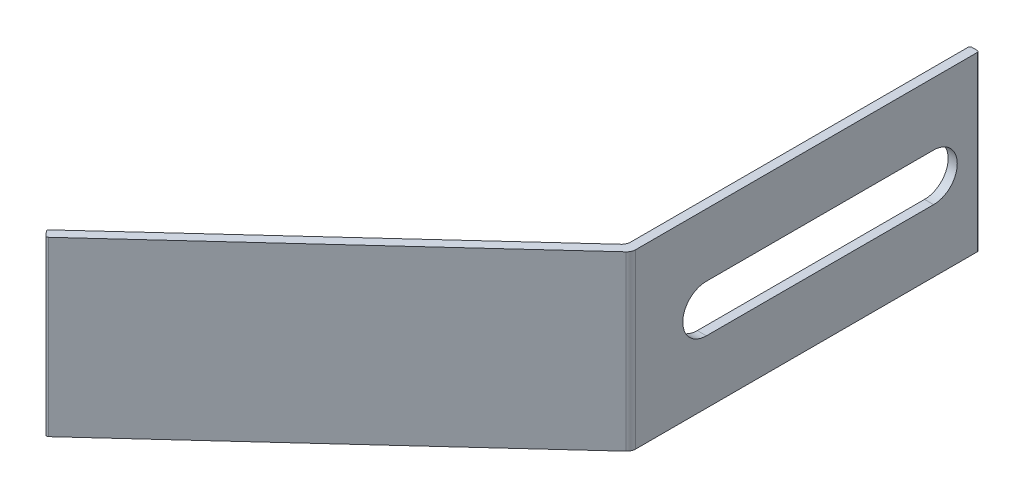
ISO-10303-21;
HEADER;
FILE_DESCRIPTION(('STEP AP214'),'2;1');
FILE_NAME('part.step','',(''),(''),'','','');
FILE_SCHEMA(('AUTOMOTIVE_DESIGN { 1 0 10303 214 1 1 1 1 }'));
ENDSEC;
DATA;
#1=APPLICATION_CONTEXT('core data for automotive mechanical design processes');
#2=APPLICATION_PROTOCOL_DEFINITION('international standard','automotive_design',2000,#1);
#3=PRODUCT_CONTEXT('',#1,'mechanical');
#4=PRODUCT('Part','Part','',(#3));
#5=PRODUCT_RELATED_PRODUCT_CATEGORY('part','',(#4));
#6=PRODUCT_DEFINITION_FORMATION('','',#4);
#7=PRODUCT_DEFINITION_CONTEXT('part definition',#1,'design');
#8=PRODUCT_DEFINITION('design','',#6,#7);
#9=PRODUCT_DEFINITION_SHAPE('','',#8);
#10=(LENGTH_UNIT() NAMED_UNIT(*) SI_UNIT(.MILLI.,.METRE.));
#11=(NAMED_UNIT(*) PLANE_ANGLE_UNIT() SI_UNIT($,.RADIAN.));
#12=(NAMED_UNIT(*) SI_UNIT($,.STERADIAN.) SOLID_ANGLE_UNIT());
#13=UNCERTAINTY_MEASURE_WITH_UNIT(LENGTH_MEASURE(1.E-05),#10,'distance_accuracy_value','');
#14=(GEOMETRIC_REPRESENTATION_CONTEXT(3) GLOBAL_UNCERTAINTY_ASSIGNED_CONTEXT((#13)) GLOBAL_UNIT_ASSIGNED_CONTEXT((#10,
#11,#12)) REPRESENTATION_CONTEXT('',''));
#15=CARTESIAN_POINT('',(0.,0.,0.));
#16=DIRECTION('',(0.,0.,1.));
#17=DIRECTION('',(1.,0.,0.));
#18=AXIS2_PLACEMENT_3D('',#15,#16,#17);
#19=CARTESIAN_POINT('',(-0.337795103807825,9.5,37.6313613315949));
#20=DIRECTION('',(0.675590207615659,0.,0.737277336810125));
#21=DIRECTION('',(0.737277336810125,0.,-0.675590207615659));
#22=AXIS2_PLACEMENT_3D('',#19,#20,#21);
#23=PLANE('',#22);
#24=DIRECTION('',(-0.737277336810125,0.,0.675590207615659));
#25=VECTOR('',#24,1.);
#26=CARTESIAN_POINT('',(-0.337795103807825,-9.5,37.6313613315949));
#27=LINE('',#26,#25);
#28=CARTESIAN_POINT('',(-0.824409792384336,-9.5,38.0772615404724));
#29=VERTEX_POINT('',#28);
#30=CARTESIAN_POINT('',(-33.6627307276255,-9.5,68.1680387158227));
#31=VERTEX_POINT('',#30);
#32=EDGE_CURVE('E200',#29,#31,#27,.T.);
#33=ORIENTED_EDGE('',*,*,#32,.T.);
#34=DIRECTION('',(0.,-1.,0.));
#35=VECTOR('',#34,1.);
#36=CARTESIAN_POINT('',(-33.6627307276255,9.5,68.1680387158227));
#37=LINE('',#36,#35);
#38=CARTESIAN_POINT('',(-33.6627307276255,9.5,68.1680387158227));
#39=VERTEX_POINT('',#38);
#40=EDGE_CURVE('E313',#31,#39,#37,.F.);
#41=ORIENTED_EDGE('',*,*,#40,.T.);
#42=DIRECTION('',(-0.737277336810125,0.,0.675590207615659));
#43=VECTOR('',#42,1.);
#44=CARTESIAN_POINT('',(-0.337795103807825,9.5,37.6313613315949));
#45=LINE('',#44,#43);
#46=CARTESIAN_POINT('',(-0.824409792384336,9.5,38.0772615404724));
#47=VERTEX_POINT('',#46);
#48=EDGE_CURVE('E206',#47,#39,#45,.T.);
#49=ORIENTED_EDGE('',*,*,#48,.F.);
#50=DIRECTION('',(0.,-1.,0.));
#51=VECTOR('',#50,1.);
#52=CARTESIAN_POINT('',(-0.824409792384336,-9.5,38.0772615404724));
#53=LINE('',#52,#51);
#54=EDGE_CURVE('E229',#47,#29,#53,.T.);
#55=ORIENTED_EDGE('',*,*,#54,.T.);
#56=EDGE_LOOP('',(#33,#41,#49,#55));
#57=FACE_BOUND('',#56,.T.);
#58=ADVANCED_FACE('F43',(#57),#23,.F.);
#59=CARTESIAN_POINT('',(-33.1345959873718,9.5,69.040434094156));
#60=DIRECTION('',(-0.737277336810122,0.,0.675590207615663));
#61=DIRECTION('',(0.675590207615663,0.,0.737277336810122));
#62=AXIS2_PLACEMENT_3D('',#59,#60,#61);
#63=PLANE('',#62);
#64=DIRECTION('',(-0.675590207615663,0.,-0.737277336810122));
#65=VECTOR('',#64,1.);
#66=CARTESIAN_POINT('',(-33.1345959873718,-9.5,69.040434094156));
#67=LINE('',#66,#65);
#68=CARTESIAN_POINT('',(-33.269714028895,-9.5,68.892978626794));
#69=VERTEX_POINT('',#68);
#70=CARTESIAN_POINT('',(-33.6750681534644,-9.5,68.4506122247079));
#71=VERTEX_POINT('',#70);
#72=EDGE_CURVE('E233',#69,#71,#67,.T.);
#73=ORIENTED_EDGE('',*,*,#72,.F.);
#74=DIRECTION('',(0.,-1.,0.));
#75=VECTOR('',#74,1.);
#76=CARTESIAN_POINT('',(-33.269714028895,9.5,68.892978626794));
#77=LINE('',#76,#75);
#78=CARTESIAN_POINT('',(-33.269714028895,9.5,68.892978626794));
#79=VERTEX_POINT('',#78);
#80=EDGE_CURVE('E298',#69,#79,#77,.F.);
#81=ORIENTED_EDGE('',*,*,#80,.T.);
#82=DIRECTION('',(-0.675590207615663,0.,-0.737277336810122));
#83=VECTOR('',#82,1.);
#84=CARTESIAN_POINT('',(-33.1345959873718,9.5,69.040434094156));
#85=LINE('',#84,#83);
#86=CARTESIAN_POINT('',(-33.6750681534644,9.5,68.4506122247079));
#87=VERTEX_POINT('',#86);
#88=EDGE_CURVE('E210',#79,#87,#85,.T.);
#89=ORIENTED_EDGE('',*,*,#88,.T.);
#90=DIRECTION('',(0.,-1.,0.));
#91=VECTOR('',#90,1.);
#92=CARTESIAN_POINT('',(-33.6750681534644,-9.5,68.4506122247079));
#93=LINE('',#92,#91);
#94=EDGE_CURVE('E294',#87,#71,#93,.T.);
#95=ORIENTED_EDGE('',*,*,#94,.T.);
#96=EDGE_LOOP('',(#73,#81,#89,#95));
#97=FACE_BOUND('',#96,.T.);
#98=ADVANCED_FACE('F366',(#97),#63,.T.);
#99=CARTESIAN_POINT('',(0.337795103807834,9.5,38.3686386684051));
#100=DIRECTION('',(0.675590207615659,0.,0.737277336810125));
#101=DIRECTION('',(0.737277336810125,0.,-0.675590207615659));
#102=AXIS2_PLACEMENT_3D('',#99,#100,#101);
#103=PLANE('',#102);
#104=DIRECTION('',(-0.737277336810125,0.,0.675590207615659));
#105=VECTOR('',#104,1.);
#106=CARTESIAN_POINT('',(0.337795103807834,9.5,38.3686386684051));
#107=LINE('',#106,#105);
#108=CARTESIAN_POINT('',(0.175590207615663,9.5,38.5172720713642));
#109=VERTEX_POINT('',#108);
#110=CARTESIAN_POINT('',(-32.9871405200098,9.5,68.9053160526328));
#111=VERTEX_POINT('',#110);
#112=EDGE_CURVE('E215',#109,#111,#107,.T.);
#113=ORIENTED_EDGE('',*,*,#112,.T.);
#114=DIRECTION('',(0.,-1.,0.));
#115=VECTOR('',#114,1.);
#116=CARTESIAN_POINT('',(-32.9871405200098,9.5,68.9053160526328));
#117=LINE('',#116,#115);
#118=CARTESIAN_POINT('',(-32.9871405200098,-9.5,68.9053160526328));
#119=VERTEX_POINT('',#118);
#120=EDGE_CURVE('E278',#111,#119,#117,.T.);
#121=ORIENTED_EDGE('',*,*,#120,.T.);
#122=DIRECTION('',(-0.737277336810125,0.,0.675590207615659));
#123=VECTOR('',#122,1.);
#124=CARTESIAN_POINT('',(0.337795103807834,-9.5,38.3686386684051));
#125=LINE('',#124,#123);
#126=CARTESIAN_POINT('',(0.175590207615663,-9.5,38.5172720713642));
#127=VERTEX_POINT('',#126);
#128=EDGE_CURVE('E237',#127,#119,#125,.T.);
#129=ORIENTED_EDGE('',*,*,#128,.F.);
#130=DIRECTION('',(0.,-1.,0.));
#131=VECTOR('',#130,1.);
#132=CARTESIAN_POINT('',(0.175590207615663,9.5,38.5172720713642));
#133=LINE('',#132,#131);
#134=EDGE_CURVE('E264',#127,#109,#133,.F.);
#135=ORIENTED_EDGE('',*,*,#134,.T.);
#136=EDGE_LOOP('',(#113,#121,#129,#135));
#137=FACE_BOUND('',#136,.T.);
#138=ADVANCED_FACE('F372',(#137),#103,.T.);
#139=CARTESIAN_POINT('',(0.5,9.5,0.));
#140=DIRECTION('',(1.,0.,0.));
#141=DIRECTION('',(0.,0.,-1.));
#142=AXIS2_PLACEMENT_3D('',#139,#140,#141);
#143=PLANE('',#142);
#144=CARTESIAN_POINT('',(0.500000000000005,0.,5.));
#145=DIRECTION('',(-1.,0.,0.));
#146=DIRECTION('',(0.,0.,-1.));
#147=AXIS2_PLACEMENT_3D('',#144,#145,#146);
#148=CIRCLE('',#147,2.6);
#149=CARTESIAN_POINT('',(0.500000000000005,2.6,5.));
#150=VERTEX_POINT('',#149);
#151=CARTESIAN_POINT('',(0.500000000000005,-2.6,5.));
#152=VERTEX_POINT('',#151);
#153=EDGE_CURVE('E159',#150,#152,#148,.T.);
#154=ORIENTED_EDGE('',*,*,#153,.T.);
#155=DIRECTION('',(0.,0.,1.));
#156=VECTOR('',#155,1.);
#157=CARTESIAN_POINT('',(0.500000000000008,-2.6,30.));
#158=LINE('',#157,#156);
#159=CARTESIAN_POINT('',(0.500000000000004,-2.6,30.));
#160=VERTEX_POINT('',#159);
#161=EDGE_CURVE('E169',#152,#160,#158,.T.);
#162=ORIENTED_EDGE('',*,*,#161,.T.);
#163=CARTESIAN_POINT('',(0.500000000000008,0.,30.));
#164=DIRECTION('',(-1.,0.,0.));
#165=DIRECTION('',(0.,0.,-1.));
#166=AXIS2_PLACEMENT_3D('',#163,#164,#165);
#167=CIRCLE('',#166,2.6);
#168=CARTESIAN_POINT('',(0.500000000000008,2.6,30.));
#169=VERTEX_POINT('',#168);
#170=EDGE_CURVE('E59',#160,#169,#167,.T.);
#171=ORIENTED_EDGE('',*,*,#170,.T.);
#172=DIRECTION('',(0.,0.,-1.));
#173=VECTOR('',#172,1.);
#174=CARTESIAN_POINT('',(0.500000000000005,2.6,5.));
#175=LINE('',#174,#173);
#176=EDGE_CURVE('E166',#169,#150,#175,.T.);
#177=ORIENTED_EDGE('',*,*,#176,.T.);
#178=EDGE_LOOP('',(#154,#162,#171,#177));
#179=FACE_BOUND('',#178,.T.);
#180=DIRECTION('',(0.,0.,1.));
#181=VECTOR('',#180,1.);
#182=CARTESIAN_POINT('',(0.5,-9.5,0.));
#183=LINE('',#182,#181);
#184=CARTESIAN_POINT('',(0.5,-9.5,0.2));
#185=VERTEX_POINT('',#184);
#186=CARTESIAN_POINT('',(0.500000000000005,-9.5,37.7799947345541));
#187=VERTEX_POINT('',#186);
#188=EDGE_CURVE('E241',#185,#187,#183,.T.);
#189=ORIENTED_EDGE('',*,*,#188,.F.);
#190=DIRECTION('',(0.,-1.,0.));
#191=VECTOR('',#190,1.);
#192=CARTESIAN_POINT('',(0.5,9.5,0.2));
#193=LINE('',#192,#191);
#194=CARTESIAN_POINT('',(0.5,9.5,0.2));
#195=VERTEX_POINT('',#194);
#196=EDGE_CURVE('E52',#185,#195,#193,.F.);
#197=ORIENTED_EDGE('',*,*,#196,.T.);
#198=DIRECTION('',(0.,0.,1.));
#199=VECTOR('',#198,1.);
#200=CARTESIAN_POINT('',(0.5,9.5,0.));
#201=LINE('',#200,#199);
#202=CARTESIAN_POINT('',(0.500000000000005,9.5,37.7799947345541));
#203=VERTEX_POINT('',#202);
#204=EDGE_CURVE('E219',#195,#203,#201,.T.);
#205=ORIENTED_EDGE('',*,*,#204,.T.);
#206=DIRECTION('',(0.,-1.,0.));
#207=VECTOR('',#206,1.);
#208=CARTESIAN_POINT('',(0.500000000000005,9.5,37.7799947345541));
#209=LINE('',#208,#207);
#210=EDGE_CURVE('E257',#203,#187,#209,.T.);
#211=ORIENTED_EDGE('',*,*,#210,.T.);
#212=EDGE_LOOP('',(#189,#197,#205,#211));
#213=FACE_BOUND('',#212,.T.);
#214=ADVANCED_FACE('F174',(#179,#213),#143,.T.);
#215=CARTESIAN_POINT('',(-0.5,9.5,0.));
#216=DIRECTION('',(0.,0.,-1.));
#217=DIRECTION('',(-1.,0.,0.));
#218=AXIS2_PLACEMENT_3D('',#215,#216,#217);
#219=PLANE('',#218);
#220=DIRECTION('',(1.,0.,0.));
#221=VECTOR('',#220,1.);
#222=CARTESIAN_POINT('',(-0.5,9.5,0.));
#223=LINE('',#222,#221);
#224=CARTESIAN_POINT('',(-0.3,9.5,0.));
#225=VERTEX_POINT('',#224);
#226=CARTESIAN_POINT('',(0.3,9.5,0.));
#227=VERTEX_POINT('',#226);
#228=EDGE_CURVE('E222',#225,#227,#223,.T.);
#229=ORIENTED_EDGE('',*,*,#228,.T.);
#230=DIRECTION('',(0.,-1.,0.));
#231=VECTOR('',#230,1.);
#232=CARTESIAN_POINT('',(0.3,9.5,0.));
#233=LINE('',#232,#231);
#234=CARTESIAN_POINT('',(0.3,-9.5,0.));
#235=VERTEX_POINT('',#234);
#236=EDGE_CURVE('E319',#227,#235,#233,.T.);
#237=ORIENTED_EDGE('',*,*,#236,.T.);
#238=DIRECTION('',(1.,0.,0.));
#239=VECTOR('',#238,1.);
#240=CARTESIAN_POINT('',(-0.5,-9.5,0.));
#241=LINE('',#240,#239);
#242=CARTESIAN_POINT('',(-0.3,-9.5,0.));
#243=VERTEX_POINT('',#242);
#244=EDGE_CURVE('E244',#243,#235,#241,.T.);
#245=ORIENTED_EDGE('',*,*,#244,.F.);
#246=DIRECTION('',(0.,-1.,0.));
#247=VECTOR('',#246,1.);
#248=CARTESIAN_POINT('',(-0.3,9.5,0.));
#249=LINE('',#248,#247);
#250=EDGE_CURVE('E316',#243,#225,#249,.F.);
#251=ORIENTED_EDGE('',*,*,#250,.T.);
#252=EDGE_LOOP('',(#229,#237,#245,#251));
#253=FACE_BOUND('',#252,.T.);
#254=ADVANCED_FACE('F339',(#253),#219,.T.);
#255=CARTESIAN_POINT('',(-0.5,9.5,0.));
#256=DIRECTION('',(1.,0.,0.));
#257=DIRECTION('',(0.,0.,-1.));
#258=AXIS2_PLACEMENT_3D('',#255,#256,#257);
#259=PLANE('',#258);
#260=DIRECTION('',(0.,0.,1.));
#261=VECTOR('',#260,1.);
#262=CARTESIAN_POINT('',(-0.499999999999996,-2.6,30.));
#263=LINE('',#262,#261);
#264=CARTESIAN_POINT('',(-0.499999999999999,-2.6,5.));
#265=VERTEX_POINT('',#264);
#266=CARTESIAN_POINT('',(-0.499999999999996,-2.6,30.));
#267=VERTEX_POINT('',#266);
#268=EDGE_CURVE('E191',#265,#267,#263,.T.);
#269=ORIENTED_EDGE('',*,*,#268,.F.);
#270=CARTESIAN_POINT('',(-0.499999999999999,0.,5.));
#271=DIRECTION('',(-1.,0.,0.));
#272=DIRECTION('',(0.,0.,-1.));
#273=AXIS2_PLACEMENT_3D('',#270,#271,#272);
#274=CIRCLE('',#273,2.6);
#275=CARTESIAN_POINT('',(-0.499999999999999,2.6,5.));
#276=VERTEX_POINT('',#275);
#277=EDGE_CURVE('E67',#276,#265,#274,.T.);
#278=ORIENTED_EDGE('',*,*,#277,.F.);
#279=DIRECTION('',(0.,0.,-1.));
#280=VECTOR('',#279,1.);
#281=CARTESIAN_POINT('',(-0.499999999999999,2.6,5.));
#282=LINE('',#281,#280);
#283=CARTESIAN_POINT('',(-0.499999999999996,2.6,30.));
#284=VERTEX_POINT('',#283);
#285=EDGE_CURVE('E178',#284,#276,#282,.T.);
#286=ORIENTED_EDGE('',*,*,#285,.F.);
#287=CARTESIAN_POINT('',(-0.499999999999996,0.,30.));
#288=DIRECTION('',(-1.,0.,0.));
#289=DIRECTION('',(0.,0.,-1.));
#290=AXIS2_PLACEMENT_3D('',#287,#288,#289);
#291=CIRCLE('',#290,2.6);
#292=EDGE_CURVE('E182',#267,#284,#291,.T.);
#293=ORIENTED_EDGE('',*,*,#292,.F.);
#294=EDGE_LOOP('',(#269,#278,#286,#293));
#295=FACE_BOUND('',#294,.T.);
#296=DIRECTION('',(0.,0.,1.));
#297=VECTOR('',#296,1.);
#298=CARTESIAN_POINT('',(-0.5,9.5,0.));
#299=LINE('',#298,#297);
#300=CARTESIAN_POINT('',(-0.5,9.5,0.2));
#301=VERTEX_POINT('',#300);
#302=CARTESIAN_POINT('',(-0.499999999999995,9.5,37.3399842036622));
#303=VERTEX_POINT('',#302);
#304=EDGE_CURVE('E226',#301,#303,#299,.T.);
#305=ORIENTED_EDGE('',*,*,#304,.F.);
#306=DIRECTION('',(0.,-1.,0.));
#307=VECTOR('',#306,1.);
#308=CARTESIAN_POINT('',(-0.5,-9.5,0.2));
#309=LINE('',#308,#307);
#310=CARTESIAN_POINT('',(-0.5,-9.5,0.2));
#311=VERTEX_POINT('',#310);
#312=EDGE_CURVE('E11',#301,#311,#309,.T.);
#313=ORIENTED_EDGE('',*,*,#312,.T.);
#314=DIRECTION('',(0.,0.,1.));
#315=VECTOR('',#314,1.);
#316=CARTESIAN_POINT('',(-0.5,-9.5,0.));
#317=LINE('',#316,#315);
#318=CARTESIAN_POINT('',(-0.499999999999995,-9.5,37.3399842036622));
#319=VERTEX_POINT('',#318);
#320=EDGE_CURVE('E211',#311,#319,#317,.T.);
#321=ORIENTED_EDGE('',*,*,#320,.T.);
#322=DIRECTION('',(0.,-1.,0.));
#323=VECTOR('',#322,1.);
#324=CARTESIAN_POINT('',(-0.499999999999995,9.5,37.3399842036622));
#325=LINE('',#324,#323);
#326=EDGE_CURVE('E253',#319,#303,#325,.F.);
#327=ORIENTED_EDGE('',*,*,#326,.T.);
#328=EDGE_LOOP('',(#305,#313,#321,#327));
#329=FACE_BOUND('',#328,.T.);
#330=ADVANCED_FACE('F349',(#295,#329),#259,.F.);
#331=CARTESIAN_POINT('',(0.,9.5,0.));
#332=DIRECTION('',(0.,-1.,0.));
#333=DIRECTION('',(-1.,0.,0.));
#334=AXIS2_PLACEMENT_3D('',#331,#332,#333);
#335=PLANE('',#334);
#336=ORIENTED_EDGE('',*,*,#88,.F.);
#337=CARTESIAN_POINT('',(-33.1222585615329,9.5,68.7578605852708));
#338=DIRECTION('',(0.,-1.,0.));
#339=DIRECTION('',(0.,0.,-1.));
#340=AXIS2_PLACEMENT_3D('',#337,#338,#339);
#341=CIRCLE('',#340,0.2);
#342=EDGE_CURVE('E310',#79,#111,#341,.F.);
#343=ORIENTED_EDGE('',*,*,#342,.T.);
#344=ORIENTED_EDGE('',*,*,#112,.F.);
#345=CARTESIAN_POINT('',(-0.499999999999995,9.5,37.7799947345541));
#346=DIRECTION('',(0.,-1.,0.));
#347=DIRECTION('',(0.,0.,-1.));
#348=AXIS2_PLACEMENT_3D('',#345,#346,#347);
#349=CIRCLE('',#348,1.);
#350=EDGE_CURVE('E267',#109,#203,#349,.F.);
#351=ORIENTED_EDGE('',*,*,#350,.T.);
#352=ORIENTED_EDGE('',*,*,#204,.F.);
#353=CARTESIAN_POINT('',(0.3,9.5,0.2));
#354=DIRECTION('',(0.,-1.,0.));
#355=DIRECTION('',(0.,0.,-1.));
#356=AXIS2_PLACEMENT_3D('',#353,#354,#355);
#357=CIRCLE('',#356,0.2);
#358=EDGE_CURVE('E304',#195,#227,#357,.F.);
#359=ORIENTED_EDGE('',*,*,#358,.T.);
#360=ORIENTED_EDGE('',*,*,#228,.F.);
#361=CARTESIAN_POINT('',(-0.3,9.5,0.2));
#362=DIRECTION('',(0.,-1.,0.));
#363=DIRECTION('',(0.,0.,-1.));
#364=AXIS2_PLACEMENT_3D('',#361,#362,#363);
#365=CIRCLE('',#364,0.2);
#366=EDGE_CURVE('E301',#225,#301,#365,.F.);
#367=ORIENTED_EDGE('',*,*,#366,.T.);
#368=ORIENTED_EDGE('',*,*,#304,.T.);
#369=CARTESIAN_POINT('',(-1.5,9.5,37.3399842036622));
#370=DIRECTION('',(0.,-1.,0.));
#371=DIRECTION('',(0.,0.,-1.));
#372=AXIS2_PLACEMENT_3D('',#369,#370,#371);
#373=CIRCLE('',#372,1.);
#374=EDGE_CURVE('E275',#303,#47,#373,.T.);
#375=ORIENTED_EDGE('',*,*,#374,.T.);
#376=ORIENTED_EDGE('',*,*,#48,.T.);
#377=CARTESIAN_POINT('',(-33.5276126861024,9.5,68.3154941831848));
#378=DIRECTION('',(0.,-1.,0.));
#379=DIRECTION('',(0.,0.,-1.));
#380=AXIS2_PLACEMENT_3D('',#377,#378,#379);
#381=CIRCLE('',#380,0.2);
#382=EDGE_CURVE('E307',#39,#87,#381,.F.);
#383=ORIENTED_EDGE('',*,*,#382,.T.);
#384=EDGE_LOOP('',(#336,#343,#344,#351,#352,#359,#360,#367,#368,#375,#376,#383));
#385=FACE_BOUND('',#384,.T.);
#386=ADVANCED_FACE('F330',(#385),#335,.F.);
#387=CARTESIAN_POINT('',(0.,-9.5,0.));
#388=DIRECTION('',(0.,-1.,0.));
#389=DIRECTION('',(-1.,0.,0.));
#390=AXIS2_PLACEMENT_3D('',#387,#388,#389);
#391=PLANE('',#390);
#392=ORIENTED_EDGE('',*,*,#128,.T.);
#393=CARTESIAN_POINT('',(-33.1222585615329,-9.5,68.7578605852708));
#394=DIRECTION('',(0.,-1.,0.));
#395=DIRECTION('',(0.,0.,-1.));
#396=AXIS2_PLACEMENT_3D('',#393,#394,#395);
#397=CIRCLE('',#396,0.2);
#398=EDGE_CURVE('E291',#119,#69,#397,.T.);
#399=ORIENTED_EDGE('',*,*,#398,.T.);
#400=ORIENTED_EDGE('',*,*,#72,.T.);
#401=CARTESIAN_POINT('',(-33.5276126861024,-9.5,68.3154941831848));
#402=DIRECTION('',(0.,-1.,0.));
#403=DIRECTION('',(0.,0.,-1.));
#404=AXIS2_PLACEMENT_3D('',#401,#402,#403);
#405=CIRCLE('',#404,0.2);
#406=EDGE_CURVE('E288',#71,#31,#405,.T.);
#407=ORIENTED_EDGE('',*,*,#406,.T.);
#408=ORIENTED_EDGE('',*,*,#32,.F.);
#409=CARTESIAN_POINT('',(-1.5,-9.5,37.3399842036622));
#410=DIRECTION('',(0.,-1.,0.));
#411=DIRECTION('',(0.,0.,-1.));
#412=AXIS2_PLACEMENT_3D('',#409,#410,#411);
#413=CIRCLE('',#412,1.);
#414=EDGE_CURVE('E271',#29,#319,#413,.F.);
#415=ORIENTED_EDGE('',*,*,#414,.T.);
#416=ORIENTED_EDGE('',*,*,#320,.F.);
#417=CARTESIAN_POINT('',(-0.3,-9.5,0.2));
#418=DIRECTION('',(0.,-1.,0.));
#419=DIRECTION('',(0.,0.,-1.));
#420=AXIS2_PLACEMENT_3D('',#417,#418,#419);
#421=CIRCLE('',#420,0.2);
#422=EDGE_CURVE('E282',#311,#243,#421,.T.);
#423=ORIENTED_EDGE('',*,*,#422,.T.);
#424=ORIENTED_EDGE('',*,*,#244,.T.);
#425=CARTESIAN_POINT('',(0.3,-9.5,0.2));
#426=DIRECTION('',(0.,-1.,0.));
#427=DIRECTION('',(0.,0.,-1.));
#428=AXIS2_PLACEMENT_3D('',#425,#426,#427);
#429=CIRCLE('',#428,0.2);
#430=EDGE_CURVE('E285',#235,#185,#429,.T.);
#431=ORIENTED_EDGE('',*,*,#430,.T.);
#432=ORIENTED_EDGE('',*,*,#188,.T.);
#433=CARTESIAN_POINT('',(-0.499999999999995,-9.5,37.7799947345541));
#434=DIRECTION('',(0.,-1.,0.));
#435=DIRECTION('',(0.,0.,-1.));
#436=AXIS2_PLACEMENT_3D('',#433,#434,#435);
#437=CIRCLE('',#436,1.);
#438=EDGE_CURVE('E261',#187,#127,#437,.T.);
#439=ORIENTED_EDGE('',*,*,#438,.T.);
#440=EDGE_LOOP('',(#392,#399,#400,#407,#408,#415,#416,#423,#424,#431,#432,#439));
#441=FACE_BOUND('',#440,.T.);
#442=ADVANCED_FACE('F342',(#441),#391,.T.);
#443=CARTESIAN_POINT('',(-1.5,9.5,37.3399842036622));
#444=DIRECTION('',(0.,1.,0.));
#445=DIRECTION('',(0.,0.,1.));
#446=AXIS2_PLACEMENT_3D('',#443,#444,#445);
#447=CYLINDRICAL_SURFACE('',#446,1.);
#448=ORIENTED_EDGE('',*,*,#374,.F.);
#449=ORIENTED_EDGE('',*,*,#326,.F.);
#450=ORIENTED_EDGE('',*,*,#414,.F.);
#451=ORIENTED_EDGE('',*,*,#54,.F.);
#452=EDGE_LOOP('',(#448,#449,#450,#451));
#453=FACE_BOUND('',#452,.T.);
#454=ADVANCED_FACE('F359',(#453),#447,.F.);
#455=CARTESIAN_POINT('',(-0.499999999999995,9.5,37.7799947345541));
#456=DIRECTION('',(0.,-1.,0.));
#457=DIRECTION('',(0.,0.,-1.));
#458=AXIS2_PLACEMENT_3D('',#455,#456,#457);
#459=CYLINDRICAL_SURFACE('',#458,1.);
#460=ORIENTED_EDGE('',*,*,#350,.F.);
#461=ORIENTED_EDGE('',*,*,#134,.F.);
#462=ORIENTED_EDGE('',*,*,#438,.F.);
#463=ORIENTED_EDGE('',*,*,#210,.F.);
#464=EDGE_LOOP('',(#460,#461,#462,#463));
#465=FACE_BOUND('',#464,.T.);
#466=ADVANCED_FACE('F377',(#465),#459,.T.);
#467=CARTESIAN_POINT('',(-33.1222585615329,9.5,68.7578605852708));
#468=DIRECTION('',(0.,-1.,0.));
#469=DIRECTION('',(0.,0.,-1.));
#470=AXIS2_PLACEMENT_3D('',#467,#468,#469);
#471=CYLINDRICAL_SURFACE('',#470,0.2);
#472=ORIENTED_EDGE('',*,*,#342,.F.);
#473=ORIENTED_EDGE('',*,*,#80,.F.);
#474=ORIENTED_EDGE('',*,*,#398,.F.);
#475=ORIENTED_EDGE('',*,*,#120,.F.);
#476=EDGE_LOOP('',(#472,#473,#474,#475));
#477=FACE_BOUND('',#476,.T.);
#478=ADVANCED_FACE('F369',(#477),#471,.T.);
#479=CARTESIAN_POINT('',(-33.5276126861024,9.5,68.3154941831848));
#480=DIRECTION('',(0.,1.,0.));
#481=DIRECTION('',(0.,0.,1.));
#482=AXIS2_PLACEMENT_3D('',#479,#480,#481);
#483=CYLINDRICAL_SURFACE('',#482,0.2);
#484=ORIENTED_EDGE('',*,*,#382,.F.);
#485=ORIENTED_EDGE('',*,*,#40,.F.);
#486=ORIENTED_EDGE('',*,*,#406,.F.);
#487=ORIENTED_EDGE('',*,*,#94,.F.);
#488=EDGE_LOOP('',(#484,#485,#486,#487));
#489=FACE_BOUND('',#488,.T.);
#490=ADVANCED_FACE('F361',(#489),#483,.T.);
#491=CARTESIAN_POINT('',(0.3,9.5,0.2));
#492=DIRECTION('',(0.,-1.,0.));
#493=DIRECTION('',(0.,0.,-1.));
#494=AXIS2_PLACEMENT_3D('',#491,#492,#493);
#495=CYLINDRICAL_SURFACE('',#494,0.2);
#496=ORIENTED_EDGE('',*,*,#358,.F.);
#497=ORIENTED_EDGE('',*,*,#196,.F.);
#498=ORIENTED_EDGE('',*,*,#430,.F.);
#499=ORIENTED_EDGE('',*,*,#236,.F.);
#500=EDGE_LOOP('',(#496,#497,#498,#499));
#501=FACE_BOUND('',#500,.T.);
#502=ADVANCED_FACE('F336',(#501),#495,.T.);
#503=CARTESIAN_POINT('',(-0.3,9.5,0.2));
#504=DIRECTION('',(0.,1.,0.));
#505=DIRECTION('',(0.,0.,1.));
#506=AXIS2_PLACEMENT_3D('',#503,#504,#505);
#507=CYLINDRICAL_SURFACE('',#506,0.2);
#508=ORIENTED_EDGE('',*,*,#366,.F.);
#509=ORIENTED_EDGE('',*,*,#250,.F.);
#510=ORIENTED_EDGE('',*,*,#422,.F.);
#511=ORIENTED_EDGE('',*,*,#312,.F.);
#512=EDGE_LOOP('',(#508,#509,#510,#511));
#513=FACE_BOUND('',#512,.T.);
#514=ADVANCED_FACE('F45',(#513),#507,.T.);
#515=CARTESIAN_POINT('',(0.500000000000005,0.,5.));
#516=DIRECTION('',(-1.,0.,0.));
#517=DIRECTION('',(0.,0.,1.));
#518=AXIS2_PLACEMENT_3D('',#515,#516,#517);
#519=CYLINDRICAL_SURFACE('',#518,2.6);
#520=ORIENTED_EDGE('',*,*,#277,.T.);
#521=DIRECTION('',(-1.,0.,0.));
#522=VECTOR('',#521,1.);
#523=CARTESIAN_POINT('',(0.500000000000005,-2.6,5.));
#524=LINE('',#523,#522);
#525=EDGE_CURVE('E155',#152,#265,#524,.T.);
#526=ORIENTED_EDGE('',*,*,#525,.F.);
#527=ORIENTED_EDGE('',*,*,#153,.F.);
#528=DIRECTION('',(-1.,0.,0.));
#529=VECTOR('',#528,1.);
#530=CARTESIAN_POINT('',(0.500000000000005,2.6,5.));
#531=LINE('',#530,#529);
#532=EDGE_CURVE('E197',#150,#276,#531,.T.);
#533=ORIENTED_EDGE('',*,*,#532,.T.);
#534=EDGE_LOOP('',(#520,#526,#527,#533));
#535=FACE_BOUND('',#534,.T.);
#536=ADVANCED_FACE('F157',(#535),#519,.F.);
#537=CARTESIAN_POINT('',(0.500000000000005,2.6,5.));
#538=DIRECTION('',(0.,1.,0.));
#539=DIRECTION('',(0.,0.,1.));
#540=AXIS2_PLACEMENT_3D('',#537,#538,#539);
#541=PLANE('',#540);
#542=ORIENTED_EDGE('',*,*,#285,.T.);
#543=ORIENTED_EDGE('',*,*,#532,.F.);
#544=ORIENTED_EDGE('',*,*,#176,.F.);
#545=DIRECTION('',(-1.,0.,0.));
#546=VECTOR('',#545,1.);
#547=CARTESIAN_POINT('',(0.500000000000008,2.6,30.));
#548=LINE('',#547,#546);
#549=EDGE_CURVE('E201',#169,#284,#548,.T.);
#550=ORIENTED_EDGE('',*,*,#549,.T.);
#551=EDGE_LOOP('',(#542,#543,#544,#550));
#552=FACE_BOUND('',#551,.T.);
#553=ADVANCED_FACE('F408',(#552),#541,.F.);
#554=CARTESIAN_POINT('',(0.500000000000008,0.,30.));
#555=DIRECTION('',(-1.,0.,0.));
#556=DIRECTION('',(0.,0.,1.));
#557=AXIS2_PLACEMENT_3D('',#554,#555,#556);
#558=CYLINDRICAL_SURFACE('',#557,2.6);
#559=ORIENTED_EDGE('',*,*,#292,.T.);
#560=ORIENTED_EDGE('',*,*,#549,.F.);
#561=ORIENTED_EDGE('',*,*,#170,.F.);
#562=DIRECTION('',(-1.,0.,0.));
#563=VECTOR('',#562,1.);
#564=CARTESIAN_POINT('',(0.500000000000008,-2.6,30.));
#565=LINE('',#564,#563);
#566=EDGE_CURVE('E165',#160,#267,#565,.T.);
#567=ORIENTED_EDGE('',*,*,#566,.T.);
#568=EDGE_LOOP('',(#559,#560,#561,#567));
#569=FACE_BOUND('',#568,.T.);
#570=ADVANCED_FACE('F411',(#569),#558,.F.);
#571=CARTESIAN_POINT('',(0.500000000000008,-2.6,30.));
#572=DIRECTION('',(0.,-1.,0.));
#573=DIRECTION('',(0.,0.,-1.));
#574=AXIS2_PLACEMENT_3D('',#571,#572,#573);
#575=PLANE('',#574);
#576=ORIENTED_EDGE('',*,*,#268,.T.);
#577=ORIENTED_EDGE('',*,*,#566,.F.);
#578=ORIENTED_EDGE('',*,*,#161,.F.);
#579=ORIENTED_EDGE('',*,*,#525,.T.);
#580=EDGE_LOOP('',(#576,#577,#578,#579));
#581=FACE_BOUND('',#580,.T.);
#582=ADVANCED_FACE('F170',(#581),#575,.F.);
#583=CLOSED_SHELL('',(#58,#98,#138,#214,#254,#330,#386,#442,#454,#466,#478,#490,#502,#514,#536,
#553,#570,#582));
#584=MANIFOLD_SOLID_BREP('B2',#583);
#585=ADVANCED_BREP_SHAPE_REPRESENTATION('',(#18,#584),#14);
#586=SHAPE_DEFINITION_REPRESENTATION(#9,#585);
ENDSEC;
END-ISO-10303-21;
